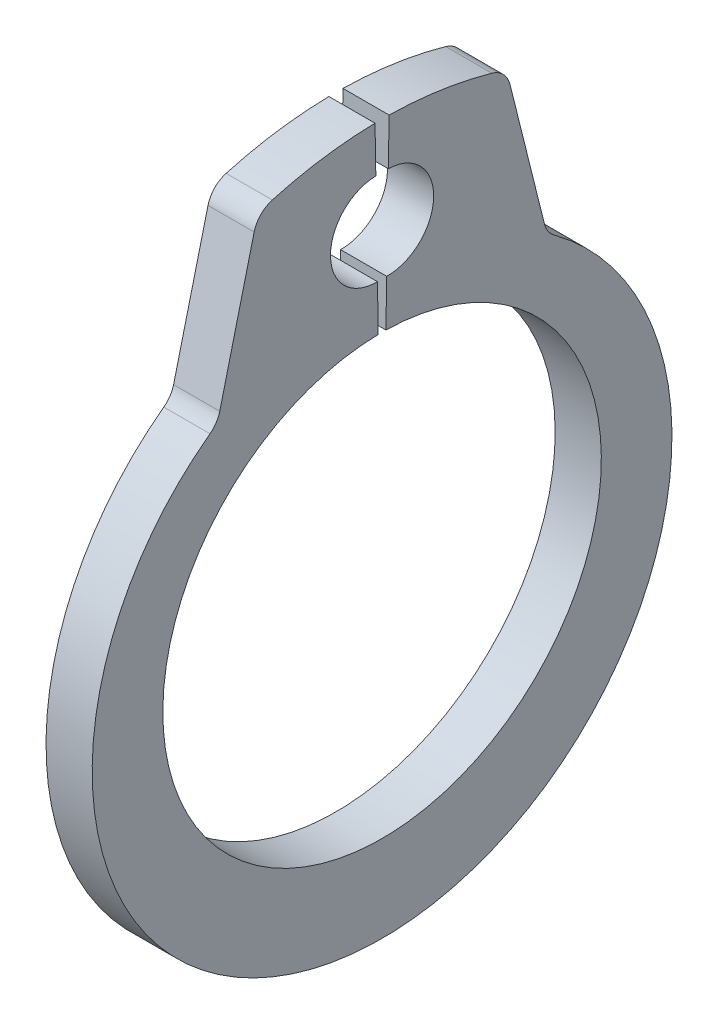
ISO-10303-21;
HEADER;
FILE_DESCRIPTION(('STEP AP214'),'2;1');
FILE_NAME('part.step','',(''),(''),'','','');
FILE_SCHEMA(('AUTOMOTIVE_DESIGN { 1 0 10303 214 1 1 1 1 }'));
ENDSEC;
DATA;
#1=APPLICATION_CONTEXT('core data for automotive mechanical design processes');
#2=APPLICATION_PROTOCOL_DEFINITION('international standard','automotive_design',2000,#1);
#3=PRODUCT_CONTEXT('',#1,'mechanical');
#4=PRODUCT('Part','Part','',(#3));
#5=PRODUCT_RELATED_PRODUCT_CATEGORY('part','',(#4));
#6=PRODUCT_DEFINITION_FORMATION('','',#4);
#7=PRODUCT_DEFINITION_CONTEXT('part definition',#1,'design');
#8=PRODUCT_DEFINITION('design','',#6,#7);
#9=PRODUCT_DEFINITION_SHAPE('','',#8);
#10=(LENGTH_UNIT() NAMED_UNIT(*) SI_UNIT(.MILLI.,.METRE.));
#11=(NAMED_UNIT(*) PLANE_ANGLE_UNIT() SI_UNIT($,.RADIAN.));
#12=(NAMED_UNIT(*) SI_UNIT($,.STERADIAN.) SOLID_ANGLE_UNIT());
#13=UNCERTAINTY_MEASURE_WITH_UNIT(LENGTH_MEASURE(1.E-05),#10,'distance_accuracy_value','');
#14=(GEOMETRIC_REPRESENTATION_CONTEXT(3) GLOBAL_UNCERTAINTY_ASSIGNED_CONTEXT((#13)) GLOBAL_UNIT_ASSIGNED_CONTEXT((#10,
#11,#12)) REPRESENTATION_CONTEXT('',''));
#15=CARTESIAN_POINT('',(0.,0.,0.));
#16=DIRECTION('',(0.,0.,1.));
#17=DIRECTION('',(1.,0.,0.));
#18=AXIS2_PLACEMENT_3D('',#15,#16,#17);
#19=CARTESIAN_POINT('',(0.4,0.,0.));
#20=DIRECTION('',(-1.,0.,0.));
#21=DIRECTION('',(0.,0.,1.));
#22=AXIS2_PLACEMENT_3D('',#19,#20,#21);
#23=CYLINDRICAL_SURFACE('',#22,3.8);
#24=CARTESIAN_POINT('',(-0.4,0.,0.));
#25=DIRECTION('',(-1.,0.,0.));
#26=DIRECTION('',(0.,0.,-1.));
#27=AXIS2_PLACEMENT_3D('',#24,#25,#26);
#28=CIRCLE('',#27,3.8);
#29=CARTESIAN_POINT('',(-0.4,3.79942124159429,-0.0663191444616775));
#30=VERTEX_POINT('',#29);
#31=CARTESIAN_POINT('',(-0.4,3.79942124159429,0.0663191444616775));
#32=VERTEX_POINT('',#31);
#33=EDGE_CURVE('E174',#30,#32,#28,.T.);
#34=ORIENTED_EDGE('',*,*,#33,.T.);
#35=DIRECTION('',(-1.,0.,0.));
#36=VECTOR('',#35,1.);
#37=CARTESIAN_POINT('',(0.4,3.79942124159429,0.0663191444616775));
#38=LINE('',#37,#36);
#39=CARTESIAN_POINT('',(0.4,3.79942124159429,0.0663191444616775));
#40=VERTEX_POINT('',#39);
#41=EDGE_CURVE('E155',#40,#32,#38,.T.);
#42=ORIENTED_EDGE('',*,*,#41,.F.);
#43=CARTESIAN_POINT('',(0.4,0.,0.));
#44=DIRECTION('',(-1.,0.,0.));
#45=DIRECTION('',(0.,0.,-1.));
#46=AXIS2_PLACEMENT_3D('',#43,#44,#45);
#47=CIRCLE('',#46,3.8);
#48=CARTESIAN_POINT('',(0.4,3.79942124159429,-0.0663191444616775));
#49=VERTEX_POINT('',#48);
#50=EDGE_CURVE('E161',#49,#40,#47,.T.);
#51=ORIENTED_EDGE('',*,*,#50,.F.);
#52=DIRECTION('',(-1.,0.,0.));
#53=VECTOR('',#52,1.);
#54=CARTESIAN_POINT('',(0.4,3.79942124159429,-0.0663191444616775));
#55=LINE('',#54,#53);
#56=EDGE_CURVE('E243',#49,#30,#55,.T.);
#57=ORIENTED_EDGE('',*,*,#56,.T.);
#58=EDGE_LOOP('',(#34,#42,#51,#57));
#59=FACE_BOUND('',#58,.T.);
#60=ADVANCED_FACE('F37',(#59),#23,.F.);
#61=CARTESIAN_POINT('',(0.4,4.5992993977194,0.0802810696115043));
#62=DIRECTION('',(0.,-0.0174524064372835,0.999847695156391));
#63=DIRECTION('',(0.,-0.999847695156391,-0.0174524064372835));
#64=AXIS2_PLACEMENT_3D('',#61,#62,#63);
#65=PLANE('',#64);
#66=DIRECTION('',(0.,0.999847695156391,0.0174524064372835));
#67=VECTOR('',#66,1.);
#68=CARTESIAN_POINT('',(-0.4,4.5992993977194,0.0802810696115043));
#69=LINE('',#68,#67);
#70=CARTESIAN_POINT('',(-0.4,4.5992993977194,0.0802810696115043));
#71=VERTEX_POINT('',#70);
#72=EDGE_CURVE('E245',#32,#71,#69,.T.);
#73=ORIENTED_EDGE('',*,*,#72,.T.);
#74=DIRECTION('',(-1.,0.,0.));
#75=VECTOR('',#74,1.);
#76=CARTESIAN_POINT('',(0.4,4.5992993977194,0.0802810696115043));
#77=LINE('',#76,#75);
#78=CARTESIAN_POINT('',(0.4,4.5992993977194,0.0802810696115043));
#79=VERTEX_POINT('',#78);
#80=EDGE_CURVE('E158',#79,#71,#77,.T.);
#81=ORIENTED_EDGE('',*,*,#80,.F.);
#82=DIRECTION('',(0.,0.999847695156391,0.0174524064372835));
#83=VECTOR('',#82,1.);
#84=CARTESIAN_POINT('',(0.4,4.5992993977194,0.0802810696115043));
#85=LINE('',#84,#83);
#86=EDGE_CURVE('E151',#40,#79,#85,.T.);
#87=ORIENTED_EDGE('',*,*,#86,.F.);
#88=ORIENTED_EDGE('',*,*,#41,.T.);
#89=EDGE_LOOP('',(#73,#81,#87,#88));
#90=FACE_BOUND('',#89,.T.);
#91=ADVANCED_FACE('F153',(#90),#65,.F.);
#92=CARTESIAN_POINT('',(0.4,5.39917755384451,0.0942429947613312));
#93=DIRECTION('',(-1.,0.,0.));
#94=DIRECTION('',(0.,0.,1.));
#95=AXIS2_PLACEMENT_3D('',#92,#93,#94);
#96=CYLINDRICAL_SURFACE('',#95,0.8);
#97=CARTESIAN_POINT('',(-0.4,5.39917755384451,0.0942429947613312));
#98=DIRECTION('',(-1.,0.,0.));
#99=DIRECTION('',(0.,0.,1.));
#100=AXIS2_PLACEMENT_3D('',#97,#98,#99);
#101=CIRCLE('',#100,0.8);
#102=CARTESIAN_POINT('',(-0.4,6.19905570996963,0.108204919911158));
#103=VERTEX_POINT('',#102);
#104=EDGE_CURVE('E247',#71,#103,#101,.T.);
#105=ORIENTED_EDGE('',*,*,#104,.T.);
#106=DIRECTION('',(-1.,0.,0.));
#107=VECTOR('',#106,1.);
#108=CARTESIAN_POINT('',(0.4,6.19905570996963,0.108204919911158));
#109=LINE('',#108,#107);
#110=CARTESIAN_POINT('',(0.4,6.19905570996963,0.108204919911158));
#111=VERTEX_POINT('',#110);
#112=EDGE_CURVE('E179',#111,#103,#109,.T.);
#113=ORIENTED_EDGE('',*,*,#112,.F.);
#114=CARTESIAN_POINT('',(0.4,5.39917755384451,0.0942429947613312));
#115=DIRECTION('',(-1.,0.,0.));
#116=DIRECTION('',(0.,0.,1.));
#117=AXIS2_PLACEMENT_3D('',#114,#115,#116);
#118=CIRCLE('',#117,0.8);
#119=EDGE_CURVE('E160',#79,#111,#118,.T.);
#120=ORIENTED_EDGE('',*,*,#119,.F.);
#121=ORIENTED_EDGE('',*,*,#80,.T.);
#122=EDGE_LOOP('',(#105,#113,#120,#121));
#123=FACE_BOUND('',#122,.T.);
#124=ADVANCED_FACE('F305',(#123),#96,.F.);
#125=CARTESIAN_POINT('',(0.4,6.19905570996963,0.108204919911158));
#126=DIRECTION('',(0.,-0.0174524064372836,0.999847695156391));
#127=DIRECTION('',(0.,-0.999847695156391,-0.0174524064372836));
#128=AXIS2_PLACEMENT_3D('',#125,#126,#127);
#129=PLANE('',#128);
#130=DIRECTION('',(0.,0.999847695156391,0.0174524064372836));
#131=VECTOR('',#130,1.);
#132=CARTESIAN_POINT('',(-0.4,6.19905570996963,0.108204919911158));
#133=LINE('',#132,#131);
#134=CARTESIAN_POINT('',(-0.4,6.99893386609474,0.122166845060985));
#135=VERTEX_POINT('',#134);
#136=EDGE_CURVE('E249',#103,#135,#133,.T.);
#137=ORIENTED_EDGE('',*,*,#136,.T.);
#138=DIRECTION('',(-1.,0.,0.));
#139=VECTOR('',#138,1.);
#140=CARTESIAN_POINT('',(0.4,6.99893386609474,0.122166845060985));
#141=LINE('',#140,#139);
#142=CARTESIAN_POINT('',(0.4,6.99893386609474,0.122166845060985));
#143=VERTEX_POINT('',#142);
#144=EDGE_CURVE('E274',#143,#135,#141,.T.);
#145=ORIENTED_EDGE('',*,*,#144,.F.);
#146=DIRECTION('',(0.,0.999847695156391,0.0174524064372836));
#147=VECTOR('',#146,1.);
#148=CARTESIAN_POINT('',(0.4,6.19905570996963,0.108204919911158));
#149=LINE('',#148,#147);
#150=EDGE_CURVE('E283',#111,#143,#149,.T.);
#151=ORIENTED_EDGE('',*,*,#150,.F.);
#152=ORIENTED_EDGE('',*,*,#112,.T.);
#153=EDGE_LOOP('',(#137,#145,#151,#152));
#154=FACE_BOUND('',#153,.T.);
#155=ADVANCED_FACE('F281',(#154),#129,.F.);
#156=CARTESIAN_POINT('',(0.4,0.,0.));
#157=DIRECTION('',(-1.,0.,0.));
#158=DIRECTION('',(0.,0.,1.));
#159=AXIS2_PLACEMENT_3D('',#156,#157,#158);
#160=CYLINDRICAL_SURFACE('',#159,7.);
#161=CARTESIAN_POINT('',(-0.4,0.,0.));
#162=DIRECTION('',(1.,0.,0.));
#163=DIRECTION('',(0.,0.,-1.));
#164=AXIS2_PLACEMENT_3D('',#161,#162,#163);
#165=CIRCLE('',#164,7.);
#166=CARTESIAN_POINT('',(-0.4,6.73645973913752,1.90265871426783));
#167=VERTEX_POINT('',#166);
#168=EDGE_CURVE('E251',#135,#167,#165,.T.);
#169=ORIENTED_EDGE('',*,*,#168,.T.);
#170=DIRECTION('',(-1.,0.,0.));
#171=VECTOR('',#170,1.);
#172=CARTESIAN_POINT('',(0.4,6.73645973913752,1.90265871426783));
#173=LINE('',#172,#171);
#174=CARTESIAN_POINT('',(0.4,6.73645973913752,1.90265871426783));
#175=VERTEX_POINT('',#174);
#176=EDGE_CURVE('E194',#167,#175,#173,.F.);
#177=ORIENTED_EDGE('',*,*,#176,.T.);
#178=CARTESIAN_POINT('',(0.4,0.,0.));
#179=DIRECTION('',(1.,0.,0.));
#180=DIRECTION('',(0.,0.,-1.));
#181=AXIS2_PLACEMENT_3D('',#178,#179,#180);
#182=CIRCLE('',#181,7.);
#183=EDGE_CURVE('E298',#143,#175,#182,.T.);
#184=ORIENTED_EDGE('',*,*,#183,.F.);
#185=ORIENTED_EDGE('',*,*,#144,.T.);
#186=EDGE_LOOP('',(#169,#177,#184,#185));
#187=FACE_BOUND('',#186,.T.);
#188=ADVANCED_FACE('F289',(#187),#160,.T.);
#189=CARTESIAN_POINT('',(0.4,6.65995631562397,2.15522200108955));
#190=DIRECTION('',(0.,-0.241921895599665,-0.970295726275997));
#191=DIRECTION('',(0.,0.970295726275997,-0.241921895599665));
#192=AXIS2_PLACEMENT_3D('',#189,#190,#191);
#193=PLANE('',#192);
#194=DIRECTION('',(0.,-0.970295726275997,0.241921895599665));
#195=VECTOR('',#194,1.);
#196=CARTESIAN_POINT('',(-0.4,6.65995631562397,2.15522200108955));
#197=LINE('',#196,#195);
#198=CARTESIAN_POINT('',(-0.4,6.41226646606995,2.21697801660338));
#199=VERTEX_POINT('',#198);
#200=CARTESIAN_POINT('',(-0.4,4.02077880718395,2.81324285841754));
#201=VERTEX_POINT('',#200);
#202=EDGE_CURVE('E225',#199,#201,#197,.T.);
#203=ORIENTED_EDGE('',*,*,#202,.T.);
#204=DIRECTION('',(1.,0.,0.));
#205=VECTOR('',#204,1.);
#206=CARTESIAN_POINT('',(0.4,4.02077880718395,2.81324285841754));
#207=LINE('',#206,#205);
#208=CARTESIAN_POINT('',(0.4,4.02077880718395,2.81324285841754));
#209=VERTEX_POINT('',#208);
#210=EDGE_CURVE('E188',#201,#209,#207,.T.);
#211=ORIENTED_EDGE('',*,*,#210,.T.);
#212=DIRECTION('',(0.,-0.970295726275997,0.241921895599665));
#213=VECTOR('',#212,1.);
#214=CARTESIAN_POINT('',(0.4,6.65995631562397,2.15522200108955));
#215=LINE('',#214,#213);
#216=CARTESIAN_POINT('',(0.4,6.41226646606995,2.21697801660338));
#217=VERTEX_POINT('',#216);
#218=EDGE_CURVE('E235',#217,#209,#215,.T.);
#219=ORIENTED_EDGE('',*,*,#218,.F.);
#220=DIRECTION('',(-1.,0.,0.));
#221=VECTOR('',#220,1.);
#222=CARTESIAN_POINT('',(0.4,6.41226646606995,2.21697801660338));
#223=LINE('',#222,#221);
#224=EDGE_CURVE('E185',#217,#199,#223,.T.);
#225=ORIENTED_EDGE('',*,*,#224,.T.);
#226=EDGE_LOOP('',(#203,#211,#219,#225));
#227=FACE_BOUND('',#226,.T.);
#228=ADVANCED_FACE('F300',(#227),#193,.F.);
#229=CARTESIAN_POINT('',(0.4,-0.275660227869133,0.));
#230=DIRECTION('',(-1.,0.,0.));
#231=DIRECTION('',(0.,0.,1.));
#232=AXIS2_PLACEMENT_3D('',#229,#230,#231);
#233=CYLINDRICAL_SURFACE('',#232,5.02433977213087);
#234=CARTESIAN_POINT('',(0.4,-0.275660227869133,0.));
#235=DIRECTION('',(1.,0.,0.));
#236=DIRECTION('',(0.,0.,-1.));
#237=AXIS2_PLACEMENT_3D('',#234,#235,#236);
#238=CIRCLE('',#237,5.02433977213087);
#239=CARTESIAN_POINT('',(0.4,3.76752022027322,2.9827306297377));
#240=VERTEX_POINT('',#239);
#241=CARTESIAN_POINT('',(0.4,3.76752022027322,-2.9827306297377));
#242=VERTEX_POINT('',#241);
#243=EDGE_CURVE('E229',#240,#242,#238,.T.);
#244=ORIENTED_EDGE('',*,*,#243,.F.);
#245=DIRECTION('',(-1.,0.,0.));
#246=VECTOR('',#245,1.);
#247=CARTESIAN_POINT('',(0.4,3.76752022027322,2.9827306297377));
#248=LINE('',#247,#246);
#249=CARTESIAN_POINT('',(-0.4,3.76752022027322,2.9827306297377));
#250=VERTEX_POINT('',#249);
#251=EDGE_CURVE('E177',#240,#250,#248,.T.);
#252=ORIENTED_EDGE('',*,*,#251,.T.);
#253=CARTESIAN_POINT('',(-0.4,-0.275660227869133,0.));
#254=DIRECTION('',(1.,0.,0.));
#255=DIRECTION('',(0.,0.,-1.));
#256=AXIS2_PLACEMENT_3D('',#253,#254,#255);
#257=CIRCLE('',#256,5.02433977213087);
#258=CARTESIAN_POINT('',(-0.4,3.76752022027322,-2.9827306297377));
#259=VERTEX_POINT('',#258);
#260=EDGE_CURVE('E215',#250,#259,#257,.T.);
#261=ORIENTED_EDGE('',*,*,#260,.T.);
#262=DIRECTION('',(-1.,0.,0.));
#263=VECTOR('',#262,1.);
#264=CARTESIAN_POINT('',(0.4,3.76752022027322,-2.9827306297377));
#265=LINE('',#264,#263);
#266=EDGE_CURVE('E175',#259,#242,#265,.F.);
#267=ORIENTED_EDGE('',*,*,#266,.T.);
#268=EDGE_LOOP('',(#244,#252,#261,#267));
#269=FACE_BOUND('',#268,.T.);
#270=ADVANCED_FACE('F222',(#269),#233,.T.);
#271=CARTESIAN_POINT('',(0.4,6.65995631562398,-2.15522200108955));
#272=DIRECTION('',(0.,-0.241921895599662,0.970295726275998));
#273=DIRECTION('',(0.,-0.970295726275998,-0.241921895599662));
#274=AXIS2_PLACEMENT_3D('',#271,#272,#273);
#275=PLANE('',#274);
#276=DIRECTION('',(0.,0.970295726275998,0.241921895599662));
#277=VECTOR('',#276,1.);
#278=CARTESIAN_POINT('',(-0.4,6.65995631562398,-2.15522200108955));
#279=LINE('',#278,#277);
#280=CARTESIAN_POINT('',(-0.4,4.02077880718395,-2.81324285841753));
#281=VERTEX_POINT('',#280);
#282=CARTESIAN_POINT('',(-0.4,6.41226646606996,-2.21697801660338));
#283=VERTEX_POINT('',#282);
#284=EDGE_CURVE('E216',#281,#283,#279,.T.);
#285=ORIENTED_EDGE('',*,*,#284,.T.);
#286=DIRECTION('',(-1.,0.,0.));
#287=VECTOR('',#286,1.);
#288=CARTESIAN_POINT('',(0.4,6.41226646606996,-2.21697801660338));
#289=LINE('',#288,#287);
#290=CARTESIAN_POINT('',(0.4,6.41226646606996,-2.21697801660338));
#291=VERTEX_POINT('',#290);
#292=EDGE_CURVE('E60',#283,#291,#289,.F.);
#293=ORIENTED_EDGE('',*,*,#292,.T.);
#294=DIRECTION('',(0.,0.970295726275998,0.241921895599662));
#295=VECTOR('',#294,1.);
#296=CARTESIAN_POINT('',(0.4,6.65995631562398,-2.15522200108955));
#297=LINE('',#296,#295);
#298=CARTESIAN_POINT('',(0.4,4.02077880718395,-2.81324285841753));
#299=VERTEX_POINT('',#298);
#300=EDGE_CURVE('E228',#299,#291,#297,.T.);
#301=ORIENTED_EDGE('',*,*,#300,.F.);
#302=DIRECTION('',(1.,0.,0.));
#303=VECTOR('',#302,1.);
#304=CARTESIAN_POINT('',(-0.4,4.02077880718395,-2.81324285841753));
#305=LINE('',#304,#303);
#306=EDGE_CURVE('E202',#299,#281,#305,.F.);
#307=ORIENTED_EDGE('',*,*,#306,.T.);
#308=EDGE_LOOP('',(#285,#293,#301,#307));
#309=FACE_BOUND('',#308,.T.);
#310=ADVANCED_FACE('F230',(#309),#275,.F.);
#311=CARTESIAN_POINT('',(0.4,0.,0.));
#312=DIRECTION('',(-1.,0.,0.));
#313=DIRECTION('',(0.,0.,1.));
#314=AXIS2_PLACEMENT_3D('',#311,#312,#313);
#315=CYLINDRICAL_SURFACE('',#314,7.00000000000001);
#316=CARTESIAN_POINT('',(0.4,0.,0.));
#317=DIRECTION('',(1.,0.,0.));
#318=DIRECTION('',(0.,0.,1.));
#319=AXIS2_PLACEMENT_3D('',#316,#317,#318);
#320=CIRCLE('',#319,7.00000000000001);
#321=CARTESIAN_POINT('',(0.4,6.73645973913753,-1.90265871426783));
#322=VERTEX_POINT('',#321);
#323=CARTESIAN_POINT('',(0.4,6.99893386609475,-0.122166845060988));
#324=VERTEX_POINT('',#323);
#325=EDGE_CURVE('E231',#322,#324,#320,.T.);
#326=ORIENTED_EDGE('',*,*,#325,.F.);
#327=DIRECTION('',(-1.,0.,0.));
#328=VECTOR('',#327,1.);
#329=CARTESIAN_POINT('',(0.4,6.73645973913752,-1.90265871426783));
#330=LINE('',#329,#328);
#331=CARTESIAN_POINT('',(-0.4,6.73645973913753,-1.90265871426783));
#332=VERTEX_POINT('',#331);
#333=EDGE_CURVE('E199',#322,#332,#330,.T.);
#334=ORIENTED_EDGE('',*,*,#333,.T.);
#335=CARTESIAN_POINT('',(-0.4,0.,0.));
#336=DIRECTION('',(1.,0.,0.));
#337=DIRECTION('',(0.,0.,1.));
#338=AXIS2_PLACEMENT_3D('',#335,#336,#337);
#339=CIRCLE('',#338,7.00000000000001);
#340=CARTESIAN_POINT('',(-0.4,6.99893386609475,-0.122166845060988));
#341=VERTEX_POINT('',#340);
#342=EDGE_CURVE('E257',#332,#341,#339,.T.);
#343=ORIENTED_EDGE('',*,*,#342,.T.);
#344=DIRECTION('',(-1.,0.,0.));
#345=VECTOR('',#344,1.);
#346=CARTESIAN_POINT('',(0.4,6.99893386609475,-0.122166845060988));
#347=LINE('',#346,#345);
#348=EDGE_CURVE('E271',#324,#341,#347,.T.);
#349=ORIENTED_EDGE('',*,*,#348,.F.);
#350=EDGE_LOOP('',(#326,#334,#343,#349));
#351=FACE_BOUND('',#350,.T.);
#352=ADVANCED_FACE('F333',(#351),#315,.T.);
#353=CARTESIAN_POINT('',(0.4,6.19905570996963,-0.108204919911161));
#354=DIRECTION('',(0.,-0.017452406437284,-0.999847695156391));
#355=DIRECTION('',(0.,0.999847695156391,-0.017452406437284));
#356=AXIS2_PLACEMENT_3D('',#353,#354,#355);
#357=PLANE('',#356);
#358=DIRECTION('',(0.,-0.999847695156391,0.017452406437284));
#359=VECTOR('',#358,1.);
#360=CARTESIAN_POINT('',(-0.4,6.19905570996963,-0.108204919911161));
#361=LINE('',#360,#359);
#362=CARTESIAN_POINT('',(-0.4,6.19905570996963,-0.108204919911161));
#363=VERTEX_POINT('',#362);
#364=EDGE_CURVE('E259',#341,#363,#361,.T.);
#365=ORIENTED_EDGE('',*,*,#364,.T.);
#366=DIRECTION('',(-1.,0.,0.));
#367=VECTOR('',#366,1.);
#368=CARTESIAN_POINT('',(0.4,6.19905570996963,-0.108204919911161));
#369=LINE('',#368,#367);
#370=CARTESIAN_POINT('',(0.4,6.19905570996963,-0.108204919911161));
#371=VERTEX_POINT('',#370);
#372=EDGE_CURVE('E268',#371,#363,#369,.T.);
#373=ORIENTED_EDGE('',*,*,#372,.F.);
#374=DIRECTION('',(0.,-0.999847695156391,0.017452406437284));
#375=VECTOR('',#374,1.);
#376=CARTESIAN_POINT('',(0.4,6.19905570996963,-0.108204919911161));
#377=LINE('',#376,#375);
#378=EDGE_CURVE('E233',#324,#371,#377,.T.);
#379=ORIENTED_EDGE('',*,*,#378,.F.);
#380=ORIENTED_EDGE('',*,*,#348,.T.);
#381=EDGE_LOOP('',(#365,#373,#379,#380));
#382=FACE_BOUND('',#381,.T.);
#383=ADVANCED_FACE('F340',(#382),#357,.F.);
#384=CARTESIAN_POINT('',(0.4,5.39917755384452,-0.0942429947613335));
#385=DIRECTION('',(-1.,0.,0.));
#386=DIRECTION('',(0.,0.,1.));
#387=AXIS2_PLACEMENT_3D('',#384,#385,#386);
#388=CYLINDRICAL_SURFACE('',#387,0.8);
#389=CARTESIAN_POINT('',(-0.4,5.39917755384452,-0.0942429947613335));
#390=DIRECTION('',(-1.,0.,0.));
#391=DIRECTION('',(0.,0.,1.));
#392=AXIS2_PLACEMENT_3D('',#389,#390,#391);
#393=CIRCLE('',#392,0.8);
#394=CARTESIAN_POINT('',(-0.4,4.5992993977194,-0.0802810696115063));
#395=VERTEX_POINT('',#394);
#396=EDGE_CURVE('E261',#363,#395,#393,.T.);
#397=ORIENTED_EDGE('',*,*,#396,.T.);
#398=DIRECTION('',(-1.,0.,0.));
#399=VECTOR('',#398,1.);
#400=CARTESIAN_POINT('',(0.4,4.5992993977194,-0.0802810696115063));
#401=LINE('',#400,#399);
#402=CARTESIAN_POINT('',(0.4,4.5992993977194,-0.0802810696115063));
#403=VERTEX_POINT('',#402);
#404=EDGE_CURVE('E265',#403,#395,#401,.T.);
#405=ORIENTED_EDGE('',*,*,#404,.F.);
#406=CARTESIAN_POINT('',(0.4,5.39917755384452,-0.0942429947613335));
#407=DIRECTION('',(-1.,0.,0.));
#408=DIRECTION('',(0.,0.,1.));
#409=AXIS2_PLACEMENT_3D('',#406,#407,#408);
#410=CIRCLE('',#409,0.8);
#411=EDGE_CURVE('E240',#371,#403,#410,.T.);
#412=ORIENTED_EDGE('',*,*,#411,.F.);
#413=ORIENTED_EDGE('',*,*,#372,.T.);
#414=EDGE_LOOP('',(#397,#405,#412,#413));
#415=FACE_BOUND('',#414,.T.);
#416=ADVANCED_FACE('F344',(#415),#388,.F.);
#417=CARTESIAN_POINT('',(0.4,3.79942124159429,-0.0663191444616775));
#418=DIRECTION('',(0.,-0.017452406437286,-0.999847695156391));
#419=DIRECTION('',(0.,0.999847695156391,-0.017452406437286));
#420=AXIS2_PLACEMENT_3D('',#417,#418,#419);
#421=PLANE('',#420);
#422=DIRECTION('',(0.,-0.999847695156391,0.017452406437286));
#423=VECTOR('',#422,1.);
#424=CARTESIAN_POINT('',(-0.4,3.79942124159429,-0.0663191444616775));
#425=LINE('',#424,#423);
#426=EDGE_CURVE('E171',#395,#30,#425,.T.);
#427=ORIENTED_EDGE('',*,*,#426,.T.);
#428=ORIENTED_EDGE('',*,*,#56,.F.);
#429=DIRECTION('',(0.,-0.999847695156391,0.017452406437286));
#430=VECTOR('',#429,1.);
#431=CARTESIAN_POINT('',(0.4,3.79942124159429,-0.0663191444616775));
#432=LINE('',#431,#430);
#433=EDGE_CURVE('E167',#403,#49,#432,.T.);
#434=ORIENTED_EDGE('',*,*,#433,.F.);
#435=ORIENTED_EDGE('',*,*,#404,.T.);
#436=EDGE_LOOP('',(#427,#428,#434,#435));
#437=FACE_BOUND('',#436,.T.);
#438=ADVANCED_FACE('F347',(#437),#421,.F.);
#439=CARTESIAN_POINT('',(0.4,0.,0.));
#440=DIRECTION('',(1.,0.,0.));
#441=DIRECTION('',(0.,0.,-1.));
#442=AXIS2_PLACEMENT_3D('',#439,#440,#441);
#443=PLANE('',#442);
#444=ORIENTED_EDGE('',*,*,#183,.T.);
#445=CARTESIAN_POINT('',(0.4,6.3034016130501,1.78034493977918));
#446=DIRECTION('',(1.,0.,0.));
#447=DIRECTION('',(0.,0.,-1.));
#448=AXIS2_PLACEMENT_3D('',#445,#446,#447);
#449=CIRCLE('',#448,0.45);
#450=EDGE_CURVE('E197',#175,#217,#449,.T.);
#451=ORIENTED_EDGE('',*,*,#450,.T.);
#452=ORIENTED_EDGE('',*,*,#218,.T.);
#453=CARTESIAN_POINT('',(0.4,4.1296436602038,3.24987593524173));
#454=DIRECTION('',(1.,0.,0.));
#455=DIRECTION('',(0.,0.,-1.));
#456=AXIS2_PLACEMENT_3D('',#453,#454,#455);
#457=CIRCLE('',#456,0.45);
#458=EDGE_CURVE('E208',#209,#240,#457,.F.);
#459=ORIENTED_EDGE('',*,*,#458,.T.);
#460=ORIENTED_EDGE('',*,*,#243,.T.);
#461=CARTESIAN_POINT('',(0.4,4.1296436602038,-3.24987593524173));
#462=DIRECTION('',(1.,0.,0.));
#463=DIRECTION('',(0.,0.,-1.));
#464=AXIS2_PLACEMENT_3D('',#461,#462,#463);
#465=CIRCLE('',#464,0.45);
#466=EDGE_CURVE('E11',#242,#299,#465,.F.);
#467=ORIENTED_EDGE('',*,*,#466,.T.);
#468=ORIENTED_EDGE('',*,*,#300,.T.);
#469=CARTESIAN_POINT('',(0.4,6.30340161305011,-1.78034493977918));
#470=DIRECTION('',(1.,0.,0.));
#471=DIRECTION('',(0.,0.,-1.));
#472=AXIS2_PLACEMENT_3D('',#469,#470,#471);
#473=CIRCLE('',#472,0.45);
#474=EDGE_CURVE('E52',#291,#322,#473,.T.);
#475=ORIENTED_EDGE('',*,*,#474,.T.);
#476=ORIENTED_EDGE('',*,*,#325,.T.);
#477=ORIENTED_EDGE('',*,*,#378,.T.);
#478=ORIENTED_EDGE('',*,*,#411,.T.);
#479=ORIENTED_EDGE('',*,*,#433,.T.);
#480=ORIENTED_EDGE('',*,*,#50,.T.);
#481=ORIENTED_EDGE('',*,*,#86,.T.);
#482=ORIENTED_EDGE('',*,*,#119,.T.);
#483=ORIENTED_EDGE('',*,*,#150,.T.);
#484=EDGE_LOOP('',(#444,#451,#452,#459,#460,#467,#468,#475,#476,#477,#478,#479,#480,#481,#482,#483));
#485=FACE_BOUND('',#484,.T.);
#486=ADVANCED_FACE('F165',(#485),#443,.T.);
#487=CARTESIAN_POINT('',(-0.4,0.,0.));
#488=DIRECTION('',(1.,0.,0.));
#489=DIRECTION('',(0.,0.,-1.));
#490=AXIS2_PLACEMENT_3D('',#487,#488,#489);
#491=PLANE('',#490);
#492=ORIENTED_EDGE('',*,*,#202,.F.);
#493=CARTESIAN_POINT('',(-0.4,6.3034016130501,1.78034493977918));
#494=DIRECTION('',(1.,0.,0.));
#495=DIRECTION('',(0.,0.,-1.));
#496=AXIS2_PLACEMENT_3D('',#493,#494,#495);
#497=CIRCLE('',#496,0.45);
#498=EDGE_CURVE('E192',#199,#167,#497,.F.);
#499=ORIENTED_EDGE('',*,*,#498,.T.);
#500=ORIENTED_EDGE('',*,*,#168,.F.);
#501=ORIENTED_EDGE('',*,*,#136,.F.);
#502=ORIENTED_EDGE('',*,*,#104,.F.);
#503=ORIENTED_EDGE('',*,*,#72,.F.);
#504=ORIENTED_EDGE('',*,*,#33,.F.);
#505=ORIENTED_EDGE('',*,*,#426,.F.);
#506=ORIENTED_EDGE('',*,*,#396,.F.);
#507=ORIENTED_EDGE('',*,*,#364,.F.);
#508=ORIENTED_EDGE('',*,*,#342,.F.);
#509=CARTESIAN_POINT('',(-0.4,6.30340161305011,-1.78034493977918));
#510=DIRECTION('',(1.,0.,0.));
#511=DIRECTION('',(0.,0.,-1.));
#512=AXIS2_PLACEMENT_3D('',#509,#510,#511);
#513=CIRCLE('',#512,0.45);
#514=EDGE_CURVE('E190',#332,#283,#513,.F.);
#515=ORIENTED_EDGE('',*,*,#514,.T.);
#516=ORIENTED_EDGE('',*,*,#284,.F.);
#517=CARTESIAN_POINT('',(-0.4,4.1296436602038,-3.24987593524173));
#518=DIRECTION('',(1.,0.,0.));
#519=DIRECTION('',(0.,0.,-1.));
#520=AXIS2_PLACEMENT_3D('',#517,#518,#519);
#521=CIRCLE('',#520,0.45);
#522=EDGE_CURVE('E45',#281,#259,#521,.T.);
#523=ORIENTED_EDGE('',*,*,#522,.T.);
#524=ORIENTED_EDGE('',*,*,#260,.F.);
#525=CARTESIAN_POINT('',(-0.4,4.1296436602038,3.24987593524173));
#526=DIRECTION('',(1.,0.,0.));
#527=DIRECTION('',(0.,0.,-1.));
#528=AXIS2_PLACEMENT_3D('',#525,#526,#527);
#529=CIRCLE('',#528,0.45);
#530=EDGE_CURVE('E206',#250,#201,#529,.T.);
#531=ORIENTED_EDGE('',*,*,#530,.T.);
#532=EDGE_LOOP('',(#492,#499,#500,#501,#502,#503,#504,#505,#506,#507,#508,#515,#516,#523,#524,#531));
#533=FACE_BOUND('',#532,.T.);
#534=ADVANCED_FACE('F214',(#533),#491,.F.);
#535=CARTESIAN_POINT('',(0.4,4.1296436602038,3.24987593524173));
#536=DIRECTION('',(-1.,0.,0.));
#537=DIRECTION('',(0.,0.,1.));
#538=AXIS2_PLACEMENT_3D('',#535,#536,#537);
#539=CYLINDRICAL_SURFACE('',#538,0.45);
#540=ORIENTED_EDGE('',*,*,#458,.F.);
#541=ORIENTED_EDGE('',*,*,#210,.F.);
#542=ORIENTED_EDGE('',*,*,#530,.F.);
#543=ORIENTED_EDGE('',*,*,#251,.F.);
#544=EDGE_LOOP('',(#540,#541,#542,#543));
#545=FACE_BOUND('',#544,.T.);
#546=ADVANCED_FACE('F319',(#545),#539,.F.);
#547=CARTESIAN_POINT('',(0.4,6.3034016130501,1.78034493977918));
#548=DIRECTION('',(-1.,0.,0.));
#549=DIRECTION('',(0.,0.,1.));
#550=AXIS2_PLACEMENT_3D('',#547,#548,#549);
#551=CYLINDRICAL_SURFACE('',#550,0.45);
#552=ORIENTED_EDGE('',*,*,#450,.F.);
#553=ORIENTED_EDGE('',*,*,#176,.F.);
#554=ORIENTED_EDGE('',*,*,#498,.F.);
#555=ORIENTED_EDGE('',*,*,#224,.F.);
#556=EDGE_LOOP('',(#552,#553,#554,#555));
#557=FACE_BOUND('',#556,.T.);
#558=ADVANCED_FACE('F293',(#557),#551,.T.);
#559=CARTESIAN_POINT('',(0.4,6.30340161305011,-1.78034493977918));
#560=DIRECTION('',(-1.,0.,0.));
#561=DIRECTION('',(0.,0.,1.));
#562=AXIS2_PLACEMENT_3D('',#559,#560,#561);
#563=CYLINDRICAL_SURFACE('',#562,0.45);
#564=ORIENTED_EDGE('',*,*,#474,.F.);
#565=ORIENTED_EDGE('',*,*,#292,.F.);
#566=ORIENTED_EDGE('',*,*,#514,.F.);
#567=ORIENTED_EDGE('',*,*,#333,.F.);
#568=EDGE_LOOP('',(#564,#565,#566,#567));
#569=FACE_BOUND('',#568,.T.);
#570=ADVANCED_FACE('F324',(#569),#563,.T.);
#571=CARTESIAN_POINT('',(0.4,4.1296436602038,-3.24987593524173));
#572=DIRECTION('',(-1.,0.,0.));
#573=DIRECTION('',(0.,0.,1.));
#574=AXIS2_PLACEMENT_3D('',#571,#572,#573);
#575=CYLINDRICAL_SURFACE('',#574,0.45);
#576=ORIENTED_EDGE('',*,*,#466,.F.);
#577=ORIENTED_EDGE('',*,*,#266,.F.);
#578=ORIENTED_EDGE('',*,*,#522,.F.);
#579=ORIENTED_EDGE('',*,*,#306,.F.);
#580=EDGE_LOOP('',(#576,#577,#578,#579));
#581=FACE_BOUND('',#580,.T.);
#582=ADVANCED_FACE('F39',(#581),#575,.F.);
#583=CLOSED_SHELL('',(#60,#91,#124,#155,#188,#228,#270,#310,#352,#383,#416,#438,#486,#534,#546,
#558,#570,#582));
#584=MANIFOLD_SOLID_BREP('B2',#583);
#585=ADVANCED_BREP_SHAPE_REPRESENTATION('',(#18,#584),#14);
#586=SHAPE_DEFINITION_REPRESENTATION(#9,#585);
ENDSEC;
END-ISO-10303-21;
